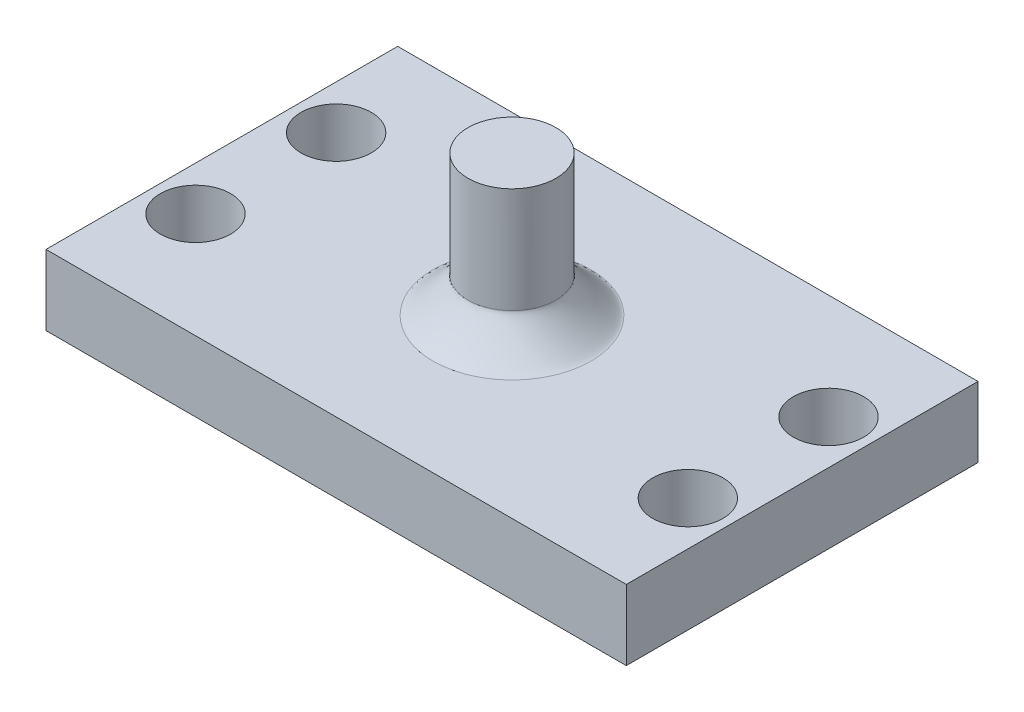
ISO-10303-21;
HEADER;
FILE_DESCRIPTION(('STEP AP214'),'2;1');
FILE_NAME('part.step','',(''),(''),'','','');
FILE_SCHEMA(('AUTOMOTIVE_DESIGN { 1 0 10303 214 1 1 1 1 }'));
ENDSEC;
DATA;
#1=APPLICATION_CONTEXT('core data for automotive mechanical design processes');
#2=APPLICATION_PROTOCOL_DEFINITION('international standard','automotive_design',2000,#1);
#3=PRODUCT_CONTEXT('',#1,'mechanical');
#4=PRODUCT('Part','Part','',(#3));
#5=PRODUCT_RELATED_PRODUCT_CATEGORY('part','',(#4));
#6=PRODUCT_DEFINITION_FORMATION('','',#4);
#7=PRODUCT_DEFINITION_CONTEXT('part definition',#1,'design');
#8=PRODUCT_DEFINITION('design','',#6,#7);
#9=PRODUCT_DEFINITION_SHAPE('','',#8);
#10=(LENGTH_UNIT() NAMED_UNIT(*) SI_UNIT(.MILLI.,.METRE.));
#11=(NAMED_UNIT(*) PLANE_ANGLE_UNIT() SI_UNIT($,.RADIAN.));
#12=(NAMED_UNIT(*) SI_UNIT($,.STERADIAN.) SOLID_ANGLE_UNIT());
#13=UNCERTAINTY_MEASURE_WITH_UNIT(LENGTH_MEASURE(1.E-05),#10,'distance_accuracy_value','');
#14=(GEOMETRIC_REPRESENTATION_CONTEXT(3) GLOBAL_UNCERTAINTY_ASSIGNED_CONTEXT((#13)) GLOBAL_UNIT_ASSIGNED_CONTEXT((#10,
#11,#12)) REPRESENTATION_CONTEXT('',''));
#15=CARTESIAN_POINT('',(0.,0.,0.));
#16=DIRECTION('',(0.,0.,1.));
#17=DIRECTION('',(1.,0.,0.));
#18=AXIS2_PLACEMENT_3D('',#15,#16,#17);
#19=CARTESIAN_POINT('',(-16.5,2.,10.));
#20=DIRECTION('',(1.,0.,0.));
#21=DIRECTION('',(0.,0.,-1.));
#22=AXIS2_PLACEMENT_3D('',#19,#20,#21);
#23=PLANE('',#22);
#24=DIRECTION('',(0.,0.,1.));
#25=VECTOR('',#24,1.);
#26=CARTESIAN_POINT('',(-16.5,-2.,10.));
#27=LINE('',#26,#25);
#28=CARTESIAN_POINT('',(-16.5,-2.,-10.));
#29=VERTEX_POINT('',#28);
#30=CARTESIAN_POINT('',(-16.5,-2.,10.));
#31=VERTEX_POINT('',#30);
#32=EDGE_CURVE('E111',#29,#31,#27,.T.);
#33=ORIENTED_EDGE('',*,*,#32,.T.);
#34=DIRECTION('',(0.,-1.,0.));
#35=VECTOR('',#34,1.);
#36=CARTESIAN_POINT('',(-16.5,2.,10.));
#37=LINE('',#36,#35);
#38=CARTESIAN_POINT('',(-16.5,2.,10.));
#39=VERTEX_POINT('',#38);
#40=EDGE_CURVE('E102',#39,#31,#37,.T.);
#41=ORIENTED_EDGE('',*,*,#40,.F.);
#42=DIRECTION('',(0.,0.,1.));
#43=VECTOR('',#42,1.);
#44=CARTESIAN_POINT('',(-16.5,2.,10.));
#45=LINE('',#44,#43);
#46=CARTESIAN_POINT('',(-16.5,2.,-10.));
#47=VERTEX_POINT('',#46);
#48=EDGE_CURVE('E96',#47,#39,#45,.T.);
#49=ORIENTED_EDGE('',*,*,#48,.F.);
#50=DIRECTION('',(0.,-1.,0.));
#51=VECTOR('',#50,1.);
#52=CARTESIAN_POINT('',(-16.5,2.,-10.));
#53=LINE('',#52,#51);
#54=EDGE_CURVE('E107',#47,#29,#53,.T.);
#55=ORIENTED_EDGE('',*,*,#54,.T.);
#56=EDGE_LOOP('',(#33,#41,#49,#55));
#57=FACE_BOUND('',#56,.T.);
#58=ADVANCED_FACE('F37',(#57),#23,.F.);
#59=CARTESIAN_POINT('',(16.5,2.,10.));
#60=DIRECTION('',(0.,0.,-1.));
#61=DIRECTION('',(-1.,0.,0.));
#62=AXIS2_PLACEMENT_3D('',#59,#60,#61);
#63=PLANE('',#62);
#64=DIRECTION('',(1.,0.,0.));
#65=VECTOR('',#64,1.);
#66=CARTESIAN_POINT('',(16.5,-2.,10.));
#67=LINE('',#66,#65);
#68=CARTESIAN_POINT('',(16.5,-2.,10.));
#69=VERTEX_POINT('',#68);
#70=EDGE_CURVE('E101',#31,#69,#67,.T.);
#71=ORIENTED_EDGE('',*,*,#70,.T.);
#72=DIRECTION('',(0.,-1.,0.));
#73=VECTOR('',#72,1.);
#74=CARTESIAN_POINT('',(16.5,2.,10.));
#75=LINE('',#74,#73);
#76=CARTESIAN_POINT('',(16.5,2.,10.));
#77=VERTEX_POINT('',#76);
#78=EDGE_CURVE('E99',#77,#69,#75,.T.);
#79=ORIENTED_EDGE('',*,*,#78,.F.);
#80=DIRECTION('',(1.,0.,0.));
#81=VECTOR('',#80,1.);
#82=CARTESIAN_POINT('',(16.5,2.,10.));
#83=LINE('',#82,#81);
#84=EDGE_CURVE('E91',#39,#77,#83,.T.);
#85=ORIENTED_EDGE('',*,*,#84,.F.);
#86=ORIENTED_EDGE('',*,*,#40,.T.);
#87=EDGE_LOOP('',(#71,#79,#85,#86));
#88=FACE_BOUND('',#87,.T.);
#89=ADVANCED_FACE('F100',(#88),#63,.F.);
#90=CARTESIAN_POINT('',(16.5,2.,10.));
#91=DIRECTION('',(-1.,0.,0.));
#92=DIRECTION('',(0.,0.,1.));
#93=AXIS2_PLACEMENT_3D('',#90,#91,#92);
#94=PLANE('',#93);
#95=DIRECTION('',(0.,0.,-1.));
#96=VECTOR('',#95,1.);
#97=CARTESIAN_POINT('',(16.5,-2.,10.));
#98=LINE('',#97,#96);
#99=CARTESIAN_POINT('',(16.5,-2.,-10.));
#100=VERTEX_POINT('',#99);
#101=EDGE_CURVE('E77',#69,#100,#98,.T.);
#102=ORIENTED_EDGE('',*,*,#101,.T.);
#103=DIRECTION('',(0.,-1.,0.));
#104=VECTOR('',#103,1.);
#105=CARTESIAN_POINT('',(16.5,2.,-10.));
#106=LINE('',#105,#104);
#107=CARTESIAN_POINT('',(16.5,2.,-10.));
#108=VERTEX_POINT('',#107);
#109=EDGE_CURVE('E103',#108,#100,#106,.T.);
#110=ORIENTED_EDGE('',*,*,#109,.F.);
#111=DIRECTION('',(0.,0.,-1.));
#112=VECTOR('',#111,1.);
#113=CARTESIAN_POINT('',(16.5,2.,10.));
#114=LINE('',#113,#112);
#115=EDGE_CURVE('E94',#77,#108,#114,.T.);
#116=ORIENTED_EDGE('',*,*,#115,.F.);
#117=ORIENTED_EDGE('',*,*,#78,.T.);
#118=EDGE_LOOP('',(#102,#110,#116,#117));
#119=FACE_BOUND('',#118,.T.);
#120=ADVANCED_FACE('F105',(#119),#94,.F.);
#121=CARTESIAN_POINT('',(16.5,2.,-10.));
#122=DIRECTION('',(0.,0.,1.));
#123=DIRECTION('',(1.,0.,0.));
#124=AXIS2_PLACEMENT_3D('',#121,#122,#123);
#125=PLANE('',#124);
#126=DIRECTION('',(-1.,0.,0.));
#127=VECTOR('',#126,1.);
#128=CARTESIAN_POINT('',(16.5,-2.,-10.));
#129=LINE('',#128,#127);
#130=EDGE_CURVE('E83',#100,#29,#129,.T.);
#131=ORIENTED_EDGE('',*,*,#130,.T.);
#132=ORIENTED_EDGE('',*,*,#54,.F.);
#133=DIRECTION('',(-1.,0.,0.));
#134=VECTOR('',#133,1.);
#135=CARTESIAN_POINT('',(16.5,2.,-10.));
#136=LINE('',#135,#134);
#137=EDGE_CURVE('E60',#108,#47,#136,.T.);
#138=ORIENTED_EDGE('',*,*,#137,.F.);
#139=ORIENTED_EDGE('',*,*,#109,.T.);
#140=EDGE_LOOP('',(#131,#132,#138,#139));
#141=FACE_BOUND('',#140,.T.);
#142=ADVANCED_FACE('F161',(#141),#125,.F.);
#143=CARTESIAN_POINT('',(0.,2.,0.));
#144=DIRECTION('',(0.,1.,0.));
#145=DIRECTION('',(0.,0.,1.));
#146=AXIS2_PLACEMENT_3D('',#143,#144,#145);
#147=PLANE('',#146);
#148=CARTESIAN_POINT('',(0.,2.,4.5));
#149=CARTESIAN_POINT('',(0.58904861769985,2.,4.5));
#150=CARTESIAN_POINT('',(1.17786548409582,2.,4.38287704315228));
#151=CARTESIAN_POINT('',(2.26628540718998,2.,3.9320387494493));
#152=CARTESIAN_POINT('',(2.7654602433153,2.,3.59850078736363));
#153=CARTESIAN_POINT('',(3.59850078736363,2.,2.7654602433153));
#154=CARTESIAN_POINT('',(3.9320387494497,2.,2.26628540718993));
#155=CARTESIAN_POINT('',(4.38287704315188,2.,1.17786548409587));
#156=CARTESIAN_POINT('',(4.5,2.,0.58904861769995));
#157=CARTESIAN_POINT('',(4.5,2.,-0.589048617699949));
#158=CARTESIAN_POINT('',(4.38287704315213,2.,-1.17786548409594));
#159=CARTESIAN_POINT('',(3.93203874944945,2.,-2.26628540718987));
#160=CARTESIAN_POINT('',(3.5985007873638,2.,-2.76546024331526));
#161=CARTESIAN_POINT('',(2.76546024331512,2.,-3.59850078736368));
#162=CARTESIAN_POINT('',(2.26628540718997,2.,-3.93203874944941));
#163=CARTESIAN_POINT('',(1.17786548409585,2.,-4.38287704315216));
#164=CARTESIAN_POINT('',(0.58904861769995,2.,-4.5));
#165=CARTESIAN_POINT('',(-0.589048617699949,2.,-4.5));
#166=CARTESIAN_POINT('',(-1.17786548409583,2.,-4.38287704315217));
#167=CARTESIAN_POINT('',(-2.26628540718996,2.,-3.93203874944942));
#168=CARTESIAN_POINT('',(-2.76546024331538,2.,-3.59850078736367));
#169=CARTESIAN_POINT('',(-3.59850078736355,2.,-2.76546024331525));
#170=CARTESIAN_POINT('',(-3.93203874944947,2.,-2.26628540718997));
#171=CARTESIAN_POINT('',(-4.3828770431521,2.,-1.17786548409584));
#172=CARTESIAN_POINT('',(-4.5,2.,-0.589048617699943));
#173=CARTESIAN_POINT('',(-4.5,2.,0.589048617699958));
#174=CARTESIAN_POINT('',(-4.38287704315211,2.,1.17786548409583));
#175=CARTESIAN_POINT('',(-3.93203874944948,2.,2.26628540718996));
#176=CARTESIAN_POINT('',(-3.59850078736362,2.,2.76546024331518));
#177=CARTESIAN_POINT('',(-2.76546024331532,2.,3.59850078736373));
#178=CARTESIAN_POINT('',(-2.26628540719004,2.,3.93203874944947));
#179=CARTESIAN_POINT('',(-1.17786548409578,2.,4.3828770431521));
#180=CARTESIAN_POINT('',(-0.58904861769985,2.,4.5));
#181=CARTESIAN_POINT('',(0.,2.,4.5));
#182=(BOUNDED_CURVE() B_SPLINE_CURVE(3,(#148,#149,#150,#151,#152,#153,#154,#155,#156,#157,#158,
#159,#160,#161,#162,#163,#164,#165,#166,#167,#168,#169,#170,#171,#172,#173,#174,#175,#176,#177,
#178,#179,#180,#181),.UNSPECIFIED.,.T.,.F.) B_SPLINE_CURVE_WITH_KNOTS((4,2,2,2,2,2,2,2,2,2,2,2,
2,2,2,2,4),(0.,0.392699081698724,0.785398163397448,1.17809724509617,1.5707963267949,
1.96349540849362,2.35619449019234,2.74889357189107,3.14159265358979,3.53429173528852,
3.92699081698724,4.31968989868597,4.71238898038469,5.10508806208341,5.49778714378214,
5.89048622548086,6.28318530717959),
.UNSPECIFIED.) CURVE() GEOMETRIC_REPRESENTATION_ITEM() RATIONAL_B_SPLINE_CURVE((1.,1.,1.,1.,1.,
1.,1.,1.,1.,1.,1.,1.,1.,1.,1.,1.,1.,1.,1.,1.,1.,1.,1.,1.,1.,1.,1.,1.,1.,1.,1.,1.,1.,1.)) REPRESENTATION_ITEM(''));
#183=CARTESIAN_POINT('',(0.,2.,4.5));
#184=VERTEX_POINT('',#183);
#185=EDGE_CURVE('E12',#184,#184,#182,.F.);
#186=ORIENTED_EDGE('',*,*,#185,.T.);
#187=EDGE_LOOP('',(#186));
#188=FACE_BOUND('',#187,.T.);
#189=CARTESIAN_POINT('',(14.,2.,-4.));
#190=DIRECTION('',(0.,1.,0.));
#191=DIRECTION('',(0.,0.,-1.));
#192=AXIS2_PLACEMENT_3D('',#189,#190,#191);
#193=CIRCLE('',#192,2.);
#194=CARTESIAN_POINT('',(14.,2.,-6.00000000000001));
#195=VERTEX_POINT('',#194);
#196=EDGE_CURVE('E187',#195,#195,#193,.T.);
#197=ORIENTED_EDGE('',*,*,#196,.F.);
#198=EDGE_LOOP('',(#197));
#199=FACE_BOUND('',#198,.T.);
#200=CARTESIAN_POINT('',(14.,2.,4.));
#201=DIRECTION('',(0.,1.,0.));
#202=DIRECTION('',(0.,0.,-1.));
#203=AXIS2_PLACEMENT_3D('',#200,#201,#202);
#204=CIRCLE('',#203,2.);
#205=CARTESIAN_POINT('',(14.,2.,1.99999999999999));
#206=VERTEX_POINT('',#205);
#207=EDGE_CURVE('E191',#206,#206,#204,.T.);
#208=ORIENTED_EDGE('',*,*,#207,.F.);
#209=EDGE_LOOP('',(#208));
#210=FACE_BOUND('',#209,.T.);
#211=CARTESIAN_POINT('',(-14.,2.,4.));
#212=DIRECTION('',(0.,1.,0.));
#213=DIRECTION('',(0.,0.,1.));
#214=AXIS2_PLACEMENT_3D('',#211,#212,#213);
#215=CIRCLE('',#214,2.);
#216=CARTESIAN_POINT('',(-14.,2.,6.));
#217=VERTEX_POINT('',#216);
#218=EDGE_CURVE('E195',#217,#217,#215,.T.);
#219=ORIENTED_EDGE('',*,*,#218,.F.);
#220=EDGE_LOOP('',(#219));
#221=FACE_BOUND('',#220,.T.);
#222=CARTESIAN_POINT('',(-14.,2.,-4.));
#223=DIRECTION('',(0.,1.,0.));
#224=DIRECTION('',(0.,0.,1.));
#225=AXIS2_PLACEMENT_3D('',#222,#223,#224);
#226=CIRCLE('',#225,2.);
#227=CARTESIAN_POINT('',(-14.,2.,-2.));
#228=VERTEX_POINT('',#227);
#229=EDGE_CURVE('E198',#228,#228,#226,.T.);
#230=ORIENTED_EDGE('',*,*,#229,.F.);
#231=EDGE_LOOP('',(#230));
#232=FACE_BOUND('',#231,.T.);
#233=ORIENTED_EDGE('',*,*,#48,.T.);
#234=ORIENTED_EDGE('',*,*,#84,.T.);
#235=ORIENTED_EDGE('',*,*,#115,.T.);
#236=ORIENTED_EDGE('',*,*,#137,.T.);
#237=EDGE_LOOP('',(#233,#234,#235,#236));
#238=FACE_BOUND('',#237,.T.);
#239=ADVANCED_FACE('F92',(#188,#199,#210,#221,#232,#238),#147,.T.);
#240=CARTESIAN_POINT('',(0.,-2.,0.));
#241=DIRECTION('',(0.,1.,0.));
#242=DIRECTION('',(0.,0.,1.));
#243=AXIS2_PLACEMENT_3D('',#240,#241,#242);
#244=PLANE('',#243);
#245=CARTESIAN_POINT('',(14.,-2.,-4.));
#246=DIRECTION('',(0.,1.,0.));
#247=DIRECTION('',(0.,0.,-1.));
#248=AXIS2_PLACEMENT_3D('',#245,#246,#247);
#249=CIRCLE('',#248,2.);
#250=CARTESIAN_POINT('',(14.,-2.,-6.00000000000001));
#251=VERTEX_POINT('',#250);
#252=EDGE_CURVE('E208',#251,#251,#249,.T.);
#253=ORIENTED_EDGE('',*,*,#252,.T.);
#254=EDGE_LOOP('',(#253));
#255=FACE_BOUND('',#254,.T.);
#256=CARTESIAN_POINT('',(14.,-2.,4.));
#257=DIRECTION('',(0.,1.,0.));
#258=DIRECTION('',(0.,0.,-1.));
#259=AXIS2_PLACEMENT_3D('',#256,#257,#258);
#260=CIRCLE('',#259,2.);
#261=CARTESIAN_POINT('',(14.,-2.,1.99999999999999));
#262=VERTEX_POINT('',#261);
#263=EDGE_CURVE('E213',#262,#262,#260,.T.);
#264=ORIENTED_EDGE('',*,*,#263,.T.);
#265=EDGE_LOOP('',(#264));
#266=FACE_BOUND('',#265,.T.);
#267=CARTESIAN_POINT('',(-14.,-2.,4.));
#268=DIRECTION('',(0.,1.,0.));
#269=DIRECTION('',(0.,0.,1.));
#270=AXIS2_PLACEMENT_3D('',#267,#268,#269);
#271=CIRCLE('',#270,2.);
#272=CARTESIAN_POINT('',(-14.,-2.,6.));
#273=VERTEX_POINT('',#272);
#274=EDGE_CURVE('E200',#273,#273,#271,.T.);
#275=ORIENTED_EDGE('',*,*,#274,.T.);
#276=EDGE_LOOP('',(#275));
#277=FACE_BOUND('',#276,.T.);
#278=CARTESIAN_POINT('',(-14.,-2.,-4.));
#279=DIRECTION('',(0.,1.,0.));
#280=DIRECTION('',(0.,0.,1.));
#281=AXIS2_PLACEMENT_3D('',#278,#279,#280);
#282=CIRCLE('',#281,2.);
#283=CARTESIAN_POINT('',(-14.,-2.,-2.));
#284=VERTEX_POINT('',#283);
#285=EDGE_CURVE('E114',#284,#284,#282,.T.);
#286=ORIENTED_EDGE('',*,*,#285,.T.);
#287=EDGE_LOOP('',(#286));
#288=FACE_BOUND('',#287,.T.);
#289=ORIENTED_EDGE('',*,*,#32,.F.);
#290=ORIENTED_EDGE('',*,*,#130,.F.);
#291=ORIENTED_EDGE('',*,*,#101,.F.);
#292=ORIENTED_EDGE('',*,*,#70,.F.);
#293=EDGE_LOOP('',(#289,#290,#291,#292));
#294=FACE_BOUND('',#293,.T.);
#295=ADVANCED_FACE('F156',(#255,#266,#277,#288,#294),#244,.F.);
#296=CARTESIAN_POINT('',(-14.,-2.,-4.));
#297=DIRECTION('',(0.,1.,0.));
#298=DIRECTION('',(0.,0.,1.));
#299=AXIS2_PLACEMENT_3D('',#296,#297,#298);
#300=CYLINDRICAL_SURFACE('',#299,2.);
#301=ORIENTED_EDGE('',*,*,#285,.F.);
#302=EDGE_LOOP('',(#301));
#303=FACE_BOUND('',#302,.T.);
#304=ORIENTED_EDGE('',*,*,#229,.T.);
#305=EDGE_LOOP('',(#304));
#306=FACE_BOUND('',#305,.T.);
#307=ADVANCED_FACE('F146',(#303,#306),#300,.F.);
#308=CARTESIAN_POINT('',(-14.,-2.,4.));
#309=DIRECTION('',(0.,1.,0.));
#310=DIRECTION('',(0.,0.,1.));
#311=AXIS2_PLACEMENT_3D('',#308,#309,#310);
#312=CYLINDRICAL_SURFACE('',#311,2.);
#313=ORIENTED_EDGE('',*,*,#274,.F.);
#314=EDGE_LOOP('',(#313));
#315=FACE_BOUND('',#314,.T.);
#316=ORIENTED_EDGE('',*,*,#218,.T.);
#317=EDGE_LOOP('',(#316));
#318=FACE_BOUND('',#317,.T.);
#319=ADVANCED_FACE('F142',(#315,#318),#312,.F.);
#320=CARTESIAN_POINT('',(14.,-2.,4.));
#321=DIRECTION('',(0.,1.,0.));
#322=DIRECTION('',(0.,0.,1.));
#323=AXIS2_PLACEMENT_3D('',#320,#321,#322);
#324=CYLINDRICAL_SURFACE('',#323,2.);
#325=ORIENTED_EDGE('',*,*,#263,.F.);
#326=EDGE_LOOP('',(#325));
#327=FACE_BOUND('',#326,.T.);
#328=ORIENTED_EDGE('',*,*,#207,.T.);
#329=EDGE_LOOP('',(#328));
#330=FACE_BOUND('',#329,.T.);
#331=ADVANCED_FACE('F145',(#327,#330),#324,.F.);
#332=CARTESIAN_POINT('',(14.,-2.,-4.));
#333=DIRECTION('',(0.,1.,0.));
#334=DIRECTION('',(0.,0.,1.));
#335=AXIS2_PLACEMENT_3D('',#332,#333,#334);
#336=CYLINDRICAL_SURFACE('',#335,2.);
#337=ORIENTED_EDGE('',*,*,#252,.F.);
#338=EDGE_LOOP('',(#337));
#339=FACE_BOUND('',#338,.T.);
#340=ORIENTED_EDGE('',*,*,#196,.T.);
#341=EDGE_LOOP('',(#340));
#342=FACE_BOUND('',#341,.T.);
#343=ADVANCED_FACE('F141',(#339,#342),#336,.F.);
#344=CARTESIAN_POINT('',(0.,10.,0.));
#345=DIRECTION('',(0.,-1.,0.));
#346=DIRECTION('',(0.,0.,-1.));
#347=AXIS2_PLACEMENT_3D('',#344,#345,#346);
#348=CYLINDRICAL_SURFACE('',#347,2.5);
#349=CARTESIAN_POINT('',(0.,4.,2.5));
#350=CARTESIAN_POINT('',(-0.327249232055472,4.,2.5));
#351=CARTESIAN_POINT('',(-0.654369713386536,4.,2.43493169064009));
#352=CARTESIAN_POINT('',(-1.25904744843892,4.,2.18446597191634));
#353=CARTESIAN_POINT('',(-1.5363668018418,4.,1.99916710409094));
#354=CARTESIAN_POINT('',(-1.99916710409095,4.,1.53636680184179));
#355=CARTESIAN_POINT('',(-2.18446597191637,4.,1.25904744843886));
#356=CARTESIAN_POINT('',(-2.43493169064007,4.,0.654369713386583));
#357=CARTESIAN_POINT('',(-2.5,4.,0.327249232055532));
#358=CARTESIAN_POINT('',(-2.5,4.,-0.327249232055524));
#359=CARTESIAN_POINT('',(-2.43493169064007,4.,-0.654369713386591));
#360=CARTESIAN_POINT('',(-2.18446597191637,4.,-1.25904744843886));
#361=CARTESIAN_POINT('',(-1.99916710409093,4.,-1.53636680184181));
#362=CARTESIAN_POINT('',(-1.53636680184181,4.,-1.99916710409093));
#363=CARTESIAN_POINT('',(-1.25904744843886,4.,-2.18446597191637));
#364=CARTESIAN_POINT('',(-0.65436971338658,4.,-2.43493169064007));
#365=CARTESIAN_POINT('',(-0.327249232055527,4.,-2.5));
#366=CARTESIAN_POINT('',(0.327249232055528,4.,-2.5));
#367=CARTESIAN_POINT('',(0.654369713386587,4.,-2.43493169064007));
#368=CARTESIAN_POINT('',(1.25904744843887,4.,-2.18446597191637));
#369=CARTESIAN_POINT('',(1.53636680184174,4.,-1.999167104091));
#370=CARTESIAN_POINT('',(1.99916710409099,4.,-1.53636680184174));
#371=CARTESIAN_POINT('',(2.1844659719164,4.,-1.2590474484388));
#372=CARTESIAN_POINT('',(2.43493169064004,4.,-0.654369713386654));
#373=CARTESIAN_POINT('',(2.5,4.,-0.327249232055527));
#374=CARTESIAN_POINT('',(2.5,4.,0.327249232055528));
#375=CARTESIAN_POINT('',(2.43493169064005,4.,0.654369713386634));
#376=CARTESIAN_POINT('',(2.18446597191639,4.,1.25904744843881));
#377=CARTESIAN_POINT('',(1.99916710409092,4.,1.53636680184182));
#378=CARTESIAN_POINT('',(1.53636680184182,4.,1.99916710409092));
#379=CARTESIAN_POINT('',(1.25904744843891,4.,2.18446597191635));
#380=CARTESIAN_POINT('',(0.654369713386541,4.,2.43493169064008));
#381=CARTESIAN_POINT('',(0.327249232055472,4.,2.5));
#382=CARTESIAN_POINT('',(0.,4.,2.5));
#383=(BOUNDED_CURVE() B_SPLINE_CURVE(3,(#349,#350,#351,#352,#353,#354,#355,#356,#357,#358,#359,
#360,#361,#362,#363,#364,#365,#366,#367,#368,#369,#370,#371,#372,#373,#374,#375,#376,#377,#378,
#379,#380,#381,#382),.UNSPECIFIED.,.T.,.F.) B_SPLINE_CURVE_WITH_KNOTS((4,2,2,2,2,2,2,2,2,2,2,2,
2,2,2,2,4),(0.,0.392699081698725,0.785398163397448,1.17809724509617,1.5707963267949,
1.96349540849362,2.35619449019234,2.74889357189107,3.14159265358979,3.53429173528852,
3.92699081698724,4.31968989868597,4.71238898038469,5.10508806208341,5.49778714378214,
5.89048622548086,6.28318530717959),
.UNSPECIFIED.) CURVE() GEOMETRIC_REPRESENTATION_ITEM() RATIONAL_B_SPLINE_CURVE((1.,1.,1.,1.,1.,
1.,1.,1.,1.,1.,1.,1.,1.,1.,1.,1.,1.,1.,1.,1.,1.,1.,1.,1.,1.,1.,1.,1.,1.,1.,1.,1.,1.,1.)) REPRESENTATION_ITEM(''));
#384=CARTESIAN_POINT('',(0.,4.,2.5));
#385=VERTEX_POINT('',#384);
#386=EDGE_CURVE('E52',#385,#385,#383,.F.);
#387=ORIENTED_EDGE('',*,*,#386,.T.);
#388=EDGE_LOOP('',(#387));
#389=FACE_BOUND('',#388,.T.);
#390=CARTESIAN_POINT('',(0.,10.,0.));
#391=DIRECTION('',(0.,1.,0.));
#392=DIRECTION('',(0.,0.,1.));
#393=AXIS2_PLACEMENT_3D('',#390,#391,#392);
#394=CIRCLE('',#393,2.5);
#395=CARTESIAN_POINT('',(0.,10.,2.5));
#396=VERTEX_POINT('',#395);
#397=EDGE_CURVE('E209',#396,#396,#394,.T.);
#398=ORIENTED_EDGE('',*,*,#397,.F.);
#399=EDGE_LOOP('',(#398));
#400=FACE_BOUND('',#399,.T.);
#401=ADVANCED_FACE('F130',(#389,#400),#348,.T.);
#402=CARTESIAN_POINT('',(0.,10.,0.));
#403=DIRECTION('',(0.,1.,0.));
#404=DIRECTION('',(0.,0.,1.));
#405=AXIS2_PLACEMENT_3D('',#402,#403,#404);
#406=PLANE('',#405);
#407=ORIENTED_EDGE('',*,*,#397,.T.);
#408=EDGE_LOOP('',(#407));
#409=FACE_BOUND('',#408,.T.);
#410=ADVANCED_FACE('F140',(#409),#406,.T.);
#411=CARTESIAN_POINT('',(0.,4.,2.5));
#412=CARTESIAN_POINT('',(0.327249232055472,4.,2.5));
#413=CARTESIAN_POINT('',(0.654369713386541,4.,2.43493169064008));
#414=CARTESIAN_POINT('',(1.25904744843891,4.,2.18446597191635));
#415=CARTESIAN_POINT('',(1.53636680184182,4.,1.99916710409092));
#416=CARTESIAN_POINT('',(1.99916710409092,4.,1.53636680184182));
#417=CARTESIAN_POINT('',(2.18446597191639,4.,1.25904744843881));
#418=CARTESIAN_POINT('',(2.43493169064005,4.,0.654369713386634));
#419=CARTESIAN_POINT('',(2.5,4.,0.327249232055528));
#420=CARTESIAN_POINT('',(2.5,4.,-0.327249232055527));
#421=CARTESIAN_POINT('',(2.43493169064004,4.,-0.654369713386654));
#422=CARTESIAN_POINT('',(2.1844659719164,4.,-1.2590474484388));
#423=CARTESIAN_POINT('',(1.99916710409099,4.,-1.53636680184174));
#424=CARTESIAN_POINT('',(1.53636680184174,4.,-1.999167104091));
#425=CARTESIAN_POINT('',(1.25904744843887,4.,-2.18446597191637));
#426=CARTESIAN_POINT('',(0.654369713386587,4.,-2.43493169064007));
#427=CARTESIAN_POINT('',(0.327249232055528,4.,-2.5));
#428=CARTESIAN_POINT('',(-0.327249232055527,4.,-2.5));
#429=CARTESIAN_POINT('',(-0.65436971338658,4.,-2.43493169064007));
#430=CARTESIAN_POINT('',(-1.25904744843886,4.,-2.18446597191637));
#431=CARTESIAN_POINT('',(-1.53636680184181,4.,-1.99916710409093));
#432=CARTESIAN_POINT('',(-1.99916710409093,4.,-1.53636680184181));
#433=CARTESIAN_POINT('',(-2.18446597191637,4.,-1.25904744843886));
#434=CARTESIAN_POINT('',(-2.43493169064007,4.,-0.654369713386591));
#435=CARTESIAN_POINT('',(-2.5,4.,-0.327249232055524));
#436=CARTESIAN_POINT('',(-2.5,4.,0.327249232055532));
#437=CARTESIAN_POINT('',(-2.43493169064007,4.,0.654369713386583));
#438=CARTESIAN_POINT('',(-2.18446597191637,4.,1.25904744843886));
#439=CARTESIAN_POINT('',(-1.99916710409095,4.,1.53636680184179));
#440=CARTESIAN_POINT('',(-1.5363668018418,4.,1.99916710409094));
#441=CARTESIAN_POINT('',(-1.25904744843892,4.,2.18446597191634));
#442=CARTESIAN_POINT('',(-0.654369713386536,4.,2.43493169064009));
#443=CARTESIAN_POINT('',(-0.327249232055472,4.,2.5));
#444=CARTESIAN_POINT('',(0.,4.,2.5));
#445=CARTESIAN_POINT('',(0.,2.,2.5));
#446=CARTESIAN_POINT('',(0.327249232055472,2.,2.5));
#447=CARTESIAN_POINT('',(0.654369713386495,2.,2.43493169064013));
#448=CARTESIAN_POINT('',(1.25904744843895,2.,2.18446597191631));
#449=CARTESIAN_POINT('',(1.53636680184163,2.,1.99916710409111));
#450=CARTESIAN_POINT('',(1.99916710409111,2.,1.53636680184163));
#451=CARTESIAN_POINT('',(2.18446597191676,2.,1.25904744843894));
#452=CARTESIAN_POINT('',(2.43493169063968,2.,0.654369713386502));
#453=CARTESIAN_POINT('',(2.5,2.,0.327249232055528));
#454=CARTESIAN_POINT('',(2.5,2.,-0.327249232055527));
#455=CARTESIAN_POINT('',(2.43493169063993,2.,-0.654369713386696));
#456=CARTESIAN_POINT('',(2.1844659719165,2.,-1.25904744843876));
#457=CARTESIAN_POINT('',(1.99916710409099,2.00000000000013,-1.53636680184187));
#458=CARTESIAN_POINT('',(1.53636680184174,1.99999999999987,-1.99916710409087));
#459=CARTESIAN_POINT('',(1.25904744843897,2.,-2.1844659719165));
#460=CARTESIAN_POINT('',(0.654369713386489,2.,-2.43493169063994));
#461=CARTESIAN_POINT('',(0.327249232055528,2.,-2.5));
#462=CARTESIAN_POINT('',(-0.327249232055527,2.,-2.5));
#463=CARTESIAN_POINT('',(-0.65436971338661,2.,-2.43493169064019));
#464=CARTESIAN_POINT('',(-1.25904744843883,2.,-2.18446597191624));
#465=CARTESIAN_POINT('',(-1.53636680184181,2.,-1.99916710409093));
#466=CARTESIAN_POINT('',(-1.99916710409093,2.,-1.53636680184181));
#467=CARTESIAN_POINT('',(-2.1844659719165,2.,-1.25904744843887));
#468=CARTESIAN_POINT('',(-2.43493169063993,2.,-0.654369713386587));
#469=CARTESIAN_POINT('',(-2.5,2.,-0.327249232055524));
#470=CARTESIAN_POINT('',(-2.5,2.,0.327249232055532));
#471=CARTESIAN_POINT('',(-2.43493169064006,2.,0.654369713386676));
#472=CARTESIAN_POINT('',(-2.18446597191638,2.,1.25904744843877));
#473=CARTESIAN_POINT('',(-1.99916710409102,2.,1.53636680184179));
#474=CARTESIAN_POINT('',(-1.53636680184173,2.,1.99916710409094));
#475=CARTESIAN_POINT('',(-1.259047448439,2.,2.1844659719165));
#476=CARTESIAN_POINT('',(-0.65436971338646,2.,2.43493169063993));
#477=CARTESIAN_POINT('',(-0.327249232055472,2.,2.5));
#478=CARTESIAN_POINT('',(0.,2.,2.5));
#479=CARTESIAN_POINT('',(0.,2.,4.5));
#480=CARTESIAN_POINT('',(0.58904861769985,2.,4.5));
#481=CARTESIAN_POINT('',(1.17786548409582,2.,4.38287704315228));
#482=CARTESIAN_POINT('',(2.26628540718998,2.,3.9320387494493));
#483=CARTESIAN_POINT('',(2.7654602433153,2.,3.59850078736363));
#484=CARTESIAN_POINT('',(3.59850078736363,2.,2.7654602433153));
#485=CARTESIAN_POINT('',(3.9320387494497,2.,2.26628540718993));
#486=CARTESIAN_POINT('',(4.38287704315188,2.,1.17786548409587));
#487=CARTESIAN_POINT('',(4.5,2.,0.58904861769995));
#488=CARTESIAN_POINT('',(4.5,2.,-0.589048617699949));
#489=CARTESIAN_POINT('',(4.38287704315213,2.,-1.17786548409594));
#490=CARTESIAN_POINT('',(3.93203874944945,2.,-2.26628540718987));
#491=CARTESIAN_POINT('',(3.5985007873638,2.,-2.76546024331526));
#492=CARTESIAN_POINT('',(2.76546024331512,2.,-3.59850078736368));
#493=CARTESIAN_POINT('',(2.26628540718997,2.,-3.93203874944941));
#494=CARTESIAN_POINT('',(1.17786548409585,2.,-4.38287704315216));
#495=CARTESIAN_POINT('',(0.58904861769995,2.,-4.5));
#496=CARTESIAN_POINT('',(-0.589048617699949,2.,-4.5));
#497=CARTESIAN_POINT('',(-1.17786548409583,2.,-4.38287704315217));
#498=CARTESIAN_POINT('',(-2.26628540718996,2.,-3.93203874944942));
#499=CARTESIAN_POINT('',(-2.76546024331538,2.,-3.59850078736367));
#500=CARTESIAN_POINT('',(-3.59850078736355,2.,-2.76546024331525));
#501=CARTESIAN_POINT('',(-3.93203874944947,2.,-2.26628540718997));
#502=CARTESIAN_POINT('',(-4.3828770431521,2.,-1.17786548409584));
#503=CARTESIAN_POINT('',(-4.5,2.,-0.589048617699943));
#504=CARTESIAN_POINT('',(-4.5,2.,0.589048617699958));
#505=CARTESIAN_POINT('',(-4.38287704315211,2.,1.17786548409583));
#506=CARTESIAN_POINT('',(-3.93203874944948,2.,2.26628540718996));
#507=CARTESIAN_POINT('',(-3.59850078736362,2.,2.76546024331518));
#508=CARTESIAN_POINT('',(-2.76546024331532,2.,3.59850078736373));
#509=CARTESIAN_POINT('',(-2.26628540719004,2.,3.93203874944947));
#510=CARTESIAN_POINT('',(-1.17786548409578,2.,4.3828770431521));
#511=CARTESIAN_POINT('',(-0.58904861769985,2.,4.5));
#512=CARTESIAN_POINT('',(0.,2.,4.5));
#513=(BOUNDED_SURFACE() B_SPLINE_SURFACE(2,3,((#411,#412,#413,#414,#415,#416,#417,#418,#419,
#420,#421,#422,#423,#424,#425,#426,#427,#428,#429,#430,#431,#432,#433,#434,#435,#436,#437,#438,
#439,#440,#441,#442,#443,#444),(#445,#446,#447,#448,#449,#450,#451,#452,#453,#454,#455,#456,
#457,#458,#459,#460,#461,#462,#463,#464,#465,#466,#467,#468,#469,#470,#471,#472,#473,#474,#475,
#476,#477,#478),(#479,#480,#481,#482,#483,#484,#485,#486,#487,#488,#489,#490,#491,#492,#493,
#494,#495,#496,#497,#498,#499,#500,#501,#502,#503,#504,#505,#506,#507,#508,#509,#510,#511,
#512)),.UNSPECIFIED.,.F.,.T.,.F.) B_SPLINE_SURFACE_WITH_KNOTS((3,3),(4,2,2,2,2,2,2,2,2,2,2,2,2,
2,2,2,4),(0.,1.),(0.,0.392699081698724,0.785398163397448,1.17809724509617,1.5707963267949,
1.96349540849362,2.35619449019234,2.74889357189107,3.14159265358979,3.53429173528852,
3.92699081698724,4.31968989868597,4.71238898038469,5.10508806208341,5.49778714378214,
5.89048622548086,6.28318530717959),
.UNSPECIFIED.) GEOMETRIC_REPRESENTATION_ITEM() RATIONAL_B_SPLINE_SURFACE(((1.,1.,1.,1.,1.,1.,1.,
1.,1.,1.,1.,1.,1.,1.,1.,1.,1.,1.,1.,1.,1.,1.,1.,1.,1.,1.,1.,1.,1.,1.,1.,1.,1.,1.),
(0.14142135623731,0.14142135623731,0.14142135623731,0.14142135623731,0.14142135623731,
0.14142135623731,0.14142135623731,0.14142135623731,0.14142135623731,0.14142135623731,
0.14142135623731,0.14142135623731,0.14142135623731,0.14142135623731,0.14142135623731,
0.14142135623731,0.14142135623731,0.14142135623731,0.14142135623731,0.14142135623731,
0.14142135623731,0.14142135623731,0.14142135623731,0.14142135623731,0.14142135623731,
0.14142135623731,0.14142135623731,0.14142135623731,0.14142135623731,0.14142135623731,
0.14142135623731,0.14142135623731,0.14142135623731,0.14142135623731),(1.,1.,1.,1.,1.,1.,1.,1.,
1.,1.,1.,1.,1.,1.,1.,1.,1.,1.,1.,1.,1.,1.,1.,1.,1.,1.,1.,1.,1.,1.,1.,1.,1.,1.))) REPRESENTATION_ITEM('') SURFACE());
#514=ORIENTED_EDGE('',*,*,#185,.F.);
#515=EDGE_LOOP('',(#514));
#516=FACE_BOUND('',#515,.T.);
#517=ORIENTED_EDGE('',*,*,#386,.F.);
#518=EDGE_LOOP('',(#517));
#519=FACE_BOUND('',#518,.T.);
#520=ADVANCED_FACE('F40',(#516,#519),#513,.T.);
#521=CLOSED_SHELL('',(#58,#89,#120,#142,#239,#295,#307,#319,#331,#343,#401,#410,#520));
#522=MANIFOLD_SOLID_BREP('B2',#521);
#523=ADVANCED_BREP_SHAPE_REPRESENTATION('',(#18,#522),#14);
#524=SHAPE_DEFINITION_REPRESENTATION(#9,#523);
ENDSEC;
END-ISO-10303-21;
